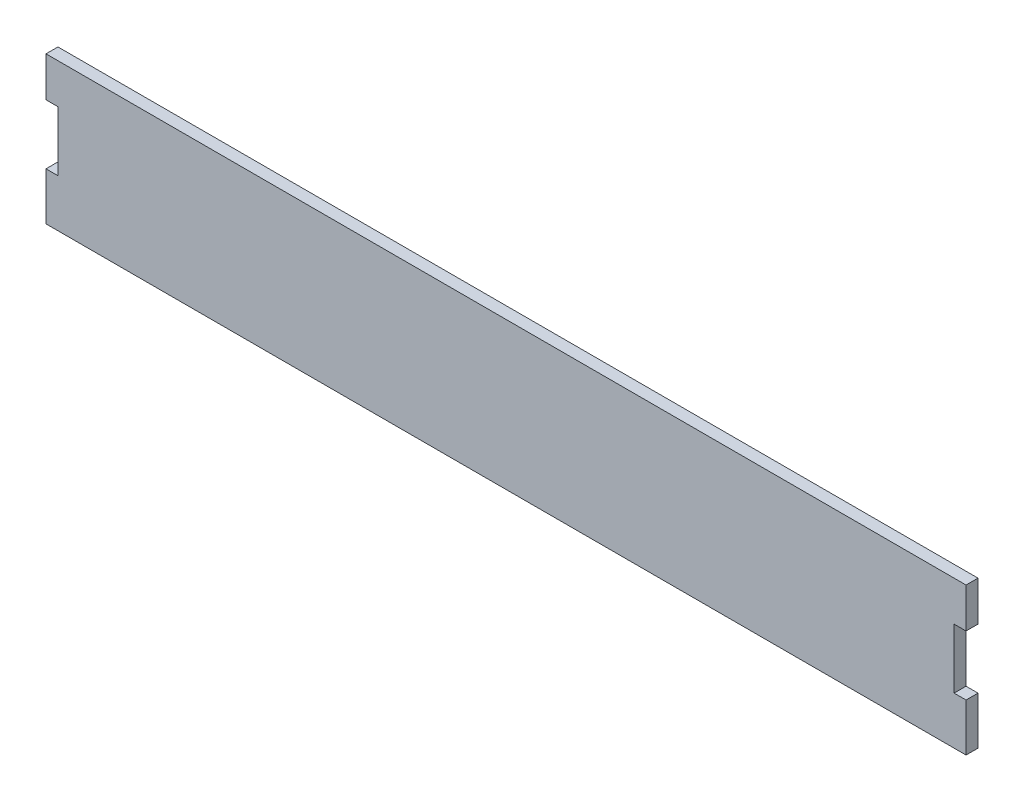
ISO-10303-21;
HEADER;
FILE_DESCRIPTION(('STEP AP214'),'2;1');
FILE_NAME('part.step','',(''),(''),'','','');
FILE_SCHEMA(('AUTOMOTIVE_DESIGN { 1 0 10303 214 1 1 1 1 }'));
ENDSEC;
DATA;
#1=APPLICATION_CONTEXT('core data for automotive mechanical design processes');
#2=APPLICATION_PROTOCOL_DEFINITION('international standard','automotive_design',2000,#1);
#3=PRODUCT_CONTEXT('',#1,'mechanical');
#4=PRODUCT('Part','Part','',(#3));
#5=PRODUCT_RELATED_PRODUCT_CATEGORY('part','',(#4));
#6=PRODUCT_DEFINITION_FORMATION('','',#4);
#7=PRODUCT_DEFINITION_CONTEXT('part definition',#1,'design');
#8=PRODUCT_DEFINITION('design','',#6,#7);
#9=PRODUCT_DEFINITION_SHAPE('','',#8);
#10=(LENGTH_UNIT() NAMED_UNIT(*) SI_UNIT(.MILLI.,.METRE.));
#11=(NAMED_UNIT(*) PLANE_ANGLE_UNIT() SI_UNIT($,.RADIAN.));
#12=(NAMED_UNIT(*) SI_UNIT($,.STERADIAN.) SOLID_ANGLE_UNIT());
#13=UNCERTAINTY_MEASURE_WITH_UNIT(LENGTH_MEASURE(1.E-05),#10,'distance_accuracy_value','');
#14=(GEOMETRIC_REPRESENTATION_CONTEXT(3) GLOBAL_UNCERTAINTY_ASSIGNED_CONTEXT((#13)) GLOBAL_UNIT_ASSIGNED_CONTEXT((#10,
#11,#12)) REPRESENTATION_CONTEXT('',''));
#15=CARTESIAN_POINT('',(0.,0.,0.));
#16=DIRECTION('',(0.,0.,1.));
#17=DIRECTION('',(1.,0.,0.));
#18=AXIS2_PLACEMENT_3D('',#15,#16,#17);
#19=CARTESIAN_POINT('',(114.5,-6.40662954709571,3.));
#20=DIRECTION('',(-1.,0.,0.));
#21=DIRECTION('',(0.,0.,1.));
#22=AXIS2_PLACEMENT_3D('',#19,#20,#21);
#23=PLANE('',#22);
#24=DIRECTION('',(0.,1.,0.));
#25=VECTOR('',#24,1.);
#26=CARTESIAN_POINT('',(114.5,-6.40662954709571,0.));
#27=LINE('',#26,#25);
#28=CARTESIAN_POINT('',(114.5,-18.383137088085,0.));
#29=VERTEX_POINT('',#28);
#30=CARTESIAN_POINT('',(114.5,-6.40662954709571,0.));
#31=VERTEX_POINT('',#30);
#32=EDGE_CURVE('E159',#29,#31,#27,.T.);
#33=ORIENTED_EDGE('',*,*,#32,.T.);
#34=DIRECTION('',(0.,0.,-1.));
#35=VECTOR('',#34,1.);
#36=CARTESIAN_POINT('',(114.5,-6.40662954709571,3.));
#37=LINE('',#36,#35);
#38=CARTESIAN_POINT('',(114.5,-6.40662954709571,3.));
#39=VERTEX_POINT('',#38);
#40=EDGE_CURVE('E42',#39,#31,#37,.T.);
#41=ORIENTED_EDGE('',*,*,#40,.F.);
#42=DIRECTION('',(0.,1.,0.));
#43=VECTOR('',#42,1.);
#44=CARTESIAN_POINT('',(114.5,-6.40662954709571,3.));
#45=LINE('',#44,#43);
#46=CARTESIAN_POINT('',(114.5,-18.383137088085,3.));
#47=VERTEX_POINT('',#46);
#48=EDGE_CURVE('E107',#47,#39,#45,.T.);
#49=ORIENTED_EDGE('',*,*,#48,.F.);
#50=DIRECTION('',(0.,0.,-1.));
#51=VECTOR('',#50,1.);
#52=CARTESIAN_POINT('',(114.5,-18.383137088085,3.));
#53=LINE('',#52,#51);
#54=EDGE_CURVE('E11',#47,#29,#53,.T.);
#55=ORIENTED_EDGE('',*,*,#54,.T.);
#56=EDGE_LOOP('',(#33,#41,#49,#55));
#57=FACE_BOUND('',#56,.T.);
#58=ADVANCED_FACE('F34',(#57),#23,.F.);
#59=CARTESIAN_POINT('',(114.5,-6.40662954709571,3.));
#60=DIRECTION('',(0.,-1.,0.));
#61=DIRECTION('',(1.,0.,0.));
#62=AXIS2_PLACEMENT_3D('',#59,#60,#61);
#63=PLANE('',#62);
#64=DIRECTION('',(-1.,0.,0.));
#65=VECTOR('',#64,1.);
#66=CARTESIAN_POINT('',(114.5,-6.40662954709571,0.));
#67=LINE('',#66,#65);
#68=CARTESIAN_POINT('',(111.5,-6.40662954709572,0.));
#69=VERTEX_POINT('',#68);
#70=EDGE_CURVE('E161',#31,#69,#67,.T.);
#71=ORIENTED_EDGE('',*,*,#70,.T.);
#72=DIRECTION('',(0.,0.,-1.));
#73=VECTOR('',#72,1.);
#74=CARTESIAN_POINT('',(111.5,-6.40662954709572,3.));
#75=LINE('',#74,#73);
#76=CARTESIAN_POINT('',(111.5,-6.40662954709572,3.));
#77=VERTEX_POINT('',#76);
#78=EDGE_CURVE('E199',#77,#69,#75,.T.);
#79=ORIENTED_EDGE('',*,*,#78,.F.);
#80=DIRECTION('',(-1.,0.,0.));
#81=VECTOR('',#80,1.);
#82=CARTESIAN_POINT('',(114.5,-6.40662954709571,3.));
#83=LINE('',#82,#81);
#84=EDGE_CURVE('E207',#39,#77,#83,.T.);
#85=ORIENTED_EDGE('',*,*,#84,.F.);
#86=ORIENTED_EDGE('',*,*,#40,.T.);
#87=EDGE_LOOP('',(#71,#79,#85,#86));
#88=FACE_BOUND('',#87,.T.);
#89=ADVANCED_FACE('F205',(#88),#63,.F.);
#90=CARTESIAN_POINT('',(111.5,8.59337045290429,3.));
#91=DIRECTION('',(-1.,0.,0.));
#92=DIRECTION('',(0.,0.,1.));
#93=AXIS2_PLACEMENT_3D('',#90,#91,#92);
#94=PLANE('',#93);
#95=DIRECTION('',(0.,1.,0.));
#96=VECTOR('',#95,1.);
#97=CARTESIAN_POINT('',(111.5,8.59337045290429,0.));
#98=LINE('',#97,#96);
#99=CARTESIAN_POINT('',(111.5,8.59337045290429,0.));
#100=VERTEX_POINT('',#99);
#101=EDGE_CURVE('E163',#69,#100,#98,.T.);
#102=ORIENTED_EDGE('',*,*,#101,.T.);
#103=DIRECTION('',(0.,0.,-1.));
#104=VECTOR('',#103,1.);
#105=CARTESIAN_POINT('',(111.5,8.59337045290429,3.));
#106=LINE('',#105,#104);
#107=CARTESIAN_POINT('',(111.5,8.59337045290429,3.));
#108=VERTEX_POINT('',#107);
#109=EDGE_CURVE('E196',#108,#100,#106,.T.);
#110=ORIENTED_EDGE('',*,*,#109,.F.);
#111=DIRECTION('',(0.,1.,0.));
#112=VECTOR('',#111,1.);
#113=CARTESIAN_POINT('',(111.5,8.59337045290429,3.));
#114=LINE('',#113,#112);
#115=EDGE_CURVE('E223',#77,#108,#114,.T.);
#116=ORIENTED_EDGE('',*,*,#115,.F.);
#117=ORIENTED_EDGE('',*,*,#78,.T.);
#118=EDGE_LOOP('',(#102,#110,#116,#117));
#119=FACE_BOUND('',#118,.T.);
#120=ADVANCED_FACE('F214',(#119),#94,.F.);
#121=CARTESIAN_POINT('',(111.5,8.59337045290429,3.));
#122=DIRECTION('',(0.,1.,0.));
#123=DIRECTION('',(0.,0.,1.));
#124=AXIS2_PLACEMENT_3D('',#121,#122,#123);
#125=PLANE('',#124);
#126=DIRECTION('',(1.,0.,0.));
#127=VECTOR('',#126,1.);
#128=CARTESIAN_POINT('',(111.5,8.59337045290429,0.));
#129=LINE('',#128,#127);
#130=CARTESIAN_POINT('',(114.5,8.59337045290429,0.));
#131=VERTEX_POINT('',#130);
#132=EDGE_CURVE('E165',#100,#131,#129,.T.);
#133=ORIENTED_EDGE('',*,*,#132,.T.);
#134=DIRECTION('',(0.,0.,-1.));
#135=VECTOR('',#134,1.);
#136=CARTESIAN_POINT('',(114.5,8.59337045290429,3.));
#137=LINE('',#136,#135);
#138=CARTESIAN_POINT('',(114.5,8.59337045290429,3.));
#139=VERTEX_POINT('',#138);
#140=EDGE_CURVE('E193',#139,#131,#137,.T.);
#141=ORIENTED_EDGE('',*,*,#140,.F.);
#142=DIRECTION('',(1.,0.,0.));
#143=VECTOR('',#142,1.);
#144=CARTESIAN_POINT('',(111.5,8.59337045290429,3.));
#145=LINE('',#144,#143);
#146=EDGE_CURVE('E220',#108,#139,#145,.T.);
#147=ORIENTED_EDGE('',*,*,#146,.F.);
#148=ORIENTED_EDGE('',*,*,#109,.T.);
#149=EDGE_LOOP('',(#133,#141,#147,#148));
#150=FACE_BOUND('',#149,.T.);
#151=ADVANCED_FACE('F218',(#150),#125,.F.);
#152=CARTESIAN_POINT('',(114.5,18.5933704529043,3.));
#153=DIRECTION('',(-1.,0.,0.));
#154=DIRECTION('',(0.,-1.,0.));
#155=AXIS2_PLACEMENT_3D('',#152,#153,#154);
#156=PLANE('',#155);
#157=DIRECTION('',(0.,1.,0.));
#158=VECTOR('',#157,1.);
#159=CARTESIAN_POINT('',(114.5,18.5933704529043,0.));
#160=LINE('',#159,#158);
#161=CARTESIAN_POINT('',(114.5,18.5933704529043,0.));
#162=VERTEX_POINT('',#161);
#163=EDGE_CURVE('E167',#131,#162,#160,.T.);
#164=ORIENTED_EDGE('',*,*,#163,.T.);
#165=DIRECTION('',(0.,0.,-1.));
#166=VECTOR('',#165,1.);
#167=CARTESIAN_POINT('',(114.5,18.5933704529043,3.));
#168=LINE('',#167,#166);
#169=CARTESIAN_POINT('',(114.5,18.5933704529043,3.));
#170=VERTEX_POINT('',#169);
#171=EDGE_CURVE('E190',#170,#162,#168,.T.);
#172=ORIENTED_EDGE('',*,*,#171,.F.);
#173=DIRECTION('',(0.,1.,0.));
#174=VECTOR('',#173,1.);
#175=CARTESIAN_POINT('',(114.5,18.5933704529043,3.));
#176=LINE('',#175,#174);
#177=EDGE_CURVE('E222',#139,#170,#176,.T.);
#178=ORIENTED_EDGE('',*,*,#177,.F.);
#179=ORIENTED_EDGE('',*,*,#140,.T.);
#180=EDGE_LOOP('',(#164,#172,#178,#179));
#181=FACE_BOUND('',#180,.T.);
#182=ADVANCED_FACE('F257',(#181),#156,.F.);
#183=CARTESIAN_POINT('',(-113.5,18.5933704529043,3.));
#184=DIRECTION('',(0.,-1.,0.));
#185=DIRECTION('',(1.,0.,0.));
#186=AXIS2_PLACEMENT_3D('',#183,#184,#185);
#187=PLANE('',#186);
#188=DIRECTION('',(-1.,0.,0.));
#189=VECTOR('',#188,1.);
#190=CARTESIAN_POINT('',(-113.5,18.5933704529043,0.));
#191=LINE('',#190,#189);
#192=CARTESIAN_POINT('',(-116.5,18.5933704529042,0.));
#193=VERTEX_POINT('',#192);
#194=EDGE_CURVE('E170',#162,#193,#191,.T.);
#195=ORIENTED_EDGE('',*,*,#194,.T.);
#196=DIRECTION('',(0.,0.,-1.));
#197=VECTOR('',#196,1.);
#198=CARTESIAN_POINT('',(-116.5,18.5933704529042,3.));
#199=LINE('',#198,#197);
#200=CARTESIAN_POINT('',(-116.5,18.5933704529042,3.));
#201=VERTEX_POINT('',#200);
#202=EDGE_CURVE('E187',#201,#193,#199,.T.);
#203=ORIENTED_EDGE('',*,*,#202,.F.);
#204=DIRECTION('',(-1.,0.,0.));
#205=VECTOR('',#204,1.);
#206=CARTESIAN_POINT('',(111.5,18.5933704529043,3.));
#207=LINE('',#206,#205);
#208=EDGE_CURVE('E225',#170,#201,#207,.T.);
#209=ORIENTED_EDGE('',*,*,#208,.F.);
#210=ORIENTED_EDGE('',*,*,#171,.T.);
#211=EDGE_LOOP('',(#195,#203,#209,#210));
#212=FACE_BOUND('',#211,.T.);
#213=ADVANCED_FACE('F260',(#212),#187,.F.);
#214=CARTESIAN_POINT('',(-116.5,18.5933704529042,3.));
#215=DIRECTION('',(1.,0.,0.));
#216=DIRECTION('',(0.,0.,-1.));
#217=AXIS2_PLACEMENT_3D('',#214,#215,#216);
#218=PLANE('',#217);
#219=DIRECTION('',(0.,-1.,0.));
#220=VECTOR('',#219,1.);
#221=CARTESIAN_POINT('',(-116.5,18.5933704529042,0.));
#222=LINE('',#221,#220);
#223=CARTESIAN_POINT('',(-116.5,8.59337045290423,0.));
#224=VERTEX_POINT('',#223);
#225=EDGE_CURVE('E172',#193,#224,#222,.T.);
#226=ORIENTED_EDGE('',*,*,#225,.T.);
#227=DIRECTION('',(0.,0.,-1.));
#228=VECTOR('',#227,1.);
#229=CARTESIAN_POINT('',(-116.5,8.59337045290423,3.));
#230=LINE('',#229,#228);
#231=CARTESIAN_POINT('',(-116.5,8.59337045290423,3.));
#232=VERTEX_POINT('',#231);
#233=EDGE_CURVE('E184',#232,#224,#230,.T.);
#234=ORIENTED_EDGE('',*,*,#233,.F.);
#235=DIRECTION('',(0.,-1.,0.));
#236=VECTOR('',#235,1.);
#237=CARTESIAN_POINT('',(-116.5,18.5933704529042,3.));
#238=LINE('',#237,#236);
#239=EDGE_CURVE('E231',#201,#232,#238,.T.);
#240=ORIENTED_EDGE('',*,*,#239,.F.);
#241=ORIENTED_EDGE('',*,*,#202,.T.);
#242=EDGE_LOOP('',(#226,#234,#240,#241));
#243=FACE_BOUND('',#242,.T.);
#244=ADVANCED_FACE('F237',(#243),#218,.F.);
#245=CARTESIAN_POINT('',(-113.5,8.59337045290429,3.));
#246=DIRECTION('',(0.,1.,0.));
#247=DIRECTION('',(-1.,0.,0.));
#248=AXIS2_PLACEMENT_3D('',#245,#246,#247);
#249=PLANE('',#248);
#250=DIRECTION('',(1.,0.,0.));
#251=VECTOR('',#250,1.);
#252=CARTESIAN_POINT('',(-113.5,8.59337045290429,0.));
#253=LINE('',#252,#251);
#254=CARTESIAN_POINT('',(-113.5,8.59337045290429,0.));
#255=VERTEX_POINT('',#254);
#256=EDGE_CURVE('E174',#224,#255,#253,.T.);
#257=ORIENTED_EDGE('',*,*,#256,.T.);
#258=DIRECTION('',(0.,0.,-1.));
#259=VECTOR('',#258,1.);
#260=CARTESIAN_POINT('',(-113.5,8.59337045290429,3.));
#261=LINE('',#260,#259);
#262=CARTESIAN_POINT('',(-113.5,8.59337045290429,3.));
#263=VERTEX_POINT('',#262);
#264=EDGE_CURVE('E148',#263,#255,#261,.T.);
#265=ORIENTED_EDGE('',*,*,#264,.F.);
#266=DIRECTION('',(1.,0.,0.));
#267=VECTOR('',#266,1.);
#268=CARTESIAN_POINT('',(-113.5,8.59337045290429,3.));
#269=LINE('',#268,#267);
#270=EDGE_CURVE('E139',#232,#263,#269,.T.);
#271=ORIENTED_EDGE('',*,*,#270,.F.);
#272=ORIENTED_EDGE('',*,*,#233,.T.);
#273=EDGE_LOOP('',(#257,#265,#271,#272));
#274=FACE_BOUND('',#273,.T.);
#275=ADVANCED_FACE('F241',(#274),#249,.F.);
#276=CARTESIAN_POINT('',(-113.5,8.59337045290429,3.));
#277=DIRECTION('',(1.,0.,0.));
#278=DIRECTION('',(0.,0.,-1.));
#279=AXIS2_PLACEMENT_3D('',#276,#277,#278);
#280=PLANE('',#279);
#281=DIRECTION('',(0.,-1.,0.));
#282=VECTOR('',#281,1.);
#283=CARTESIAN_POINT('',(-113.5,8.59337045290429,0.));
#284=LINE('',#283,#282);
#285=CARTESIAN_POINT('',(-113.5,-6.40662954709574,0.));
#286=VERTEX_POINT('',#285);
#287=EDGE_CURVE('E147',#255,#286,#284,.T.);
#288=ORIENTED_EDGE('',*,*,#287,.T.);
#289=DIRECTION('',(0.,0.,-1.));
#290=VECTOR('',#289,1.);
#291=CARTESIAN_POINT('',(-113.5,-6.40662954709574,3.));
#292=LINE('',#291,#290);
#293=CARTESIAN_POINT('',(-113.5,-6.40662954709574,3.));
#294=VERTEX_POINT('',#293);
#295=EDGE_CURVE('E144',#294,#286,#292,.T.);
#296=ORIENTED_EDGE('',*,*,#295,.F.);
#297=DIRECTION('',(0.,-1.,0.));
#298=VECTOR('',#297,1.);
#299=CARTESIAN_POINT('',(-113.5,8.59337045290429,3.));
#300=LINE('',#299,#298);
#301=EDGE_CURVE('E133',#263,#294,#300,.T.);
#302=ORIENTED_EDGE('',*,*,#301,.F.);
#303=ORIENTED_EDGE('',*,*,#264,.T.);
#304=EDGE_LOOP('',(#288,#296,#302,#303));
#305=FACE_BOUND('',#304,.T.);
#306=ADVANCED_FACE('F145',(#305),#280,.F.);
#307=CARTESIAN_POINT('',(-116.5,-6.40662954709574,3.));
#308=DIRECTION('',(0.,-1.,0.));
#309=DIRECTION('',(1.,0.,0.));
#310=AXIS2_PLACEMENT_3D('',#307,#308,#309);
#311=PLANE('',#310);
#312=DIRECTION('',(-1.,0.,0.));
#313=VECTOR('',#312,1.);
#314=CARTESIAN_POINT('',(-116.5,-6.40662954709574,0.));
#315=LINE('',#314,#313);
#316=CARTESIAN_POINT('',(-116.5,-6.40662954709574,0.));
#317=VERTEX_POINT('',#316);
#318=EDGE_CURVE('E92',#286,#317,#315,.T.);
#319=ORIENTED_EDGE('',*,*,#318,.T.);
#320=DIRECTION('',(0.,0.,-1.));
#321=VECTOR('',#320,1.);
#322=CARTESIAN_POINT('',(-116.5,-6.40662954709574,3.));
#323=LINE('',#322,#321);
#324=CARTESIAN_POINT('',(-116.5,-6.40662954709574,3.));
#325=VERTEX_POINT('',#324);
#326=EDGE_CURVE('E149',#325,#317,#323,.T.);
#327=ORIENTED_EDGE('',*,*,#326,.F.);
#328=DIRECTION('',(-1.,0.,0.));
#329=VECTOR('',#328,1.);
#330=CARTESIAN_POINT('',(-116.5,-6.40662954709574,3.));
#331=LINE('',#330,#329);
#332=EDGE_CURVE('E137',#294,#325,#331,.T.);
#333=ORIENTED_EDGE('',*,*,#332,.F.);
#334=ORIENTED_EDGE('',*,*,#295,.T.);
#335=EDGE_LOOP('',(#319,#327,#333,#334));
#336=FACE_BOUND('',#335,.T.);
#337=ADVANCED_FACE('F151',(#336),#311,.F.);
#338=CARTESIAN_POINT('',(-116.5,-6.40662954709574,3.));
#339=DIRECTION('',(1.,0.,0.));
#340=DIRECTION('',(0.,0.,-1.));
#341=AXIS2_PLACEMENT_3D('',#338,#339,#340);
#342=PLANE('',#341);
#343=DIRECTION('',(0.,-1.,0.));
#344=VECTOR('',#343,1.);
#345=CARTESIAN_POINT('',(-116.5,-6.40662954709574,0.));
#346=LINE('',#345,#344);
#347=CARTESIAN_POINT('',(-116.5,-18.3831370880851,0.));
#348=VERTEX_POINT('',#347);
#349=EDGE_CURVE('E178',#317,#348,#346,.T.);
#350=ORIENTED_EDGE('',*,*,#349,.T.);
#351=DIRECTION('',(0.,0.,-1.));
#352=VECTOR('',#351,1.);
#353=CARTESIAN_POINT('',(-116.5,-18.3831370880851,3.));
#354=LINE('',#353,#352);
#355=CARTESIAN_POINT('',(-116.5,-18.3831370880851,3.));
#356=VERTEX_POINT('',#355);
#357=EDGE_CURVE('E155',#356,#348,#354,.T.);
#358=ORIENTED_EDGE('',*,*,#357,.F.);
#359=DIRECTION('',(0.,-1.,0.));
#360=VECTOR('',#359,1.);
#361=CARTESIAN_POINT('',(-116.5,-6.40662954709574,3.));
#362=LINE('',#361,#360);
#363=EDGE_CURVE('E153',#325,#356,#362,.T.);
#364=ORIENTED_EDGE('',*,*,#363,.F.);
#365=ORIENTED_EDGE('',*,*,#326,.T.);
#366=EDGE_LOOP('',(#350,#358,#364,#365));
#367=FACE_BOUND('',#366,.T.);
#368=ADVANCED_FACE('F244',(#367),#342,.F.);
#369=CARTESIAN_POINT('',(-110.239280743278,-18.3831370880851,3.));
#370=DIRECTION('',(0.,1.,0.));
#371=DIRECTION('',(-1.,0.,0.));
#372=AXIS2_PLACEMENT_3D('',#369,#370,#371);
#373=PLANE('',#372);
#374=DIRECTION('',(1.,0.,0.));
#375=VECTOR('',#374,1.);
#376=CARTESIAN_POINT('',(-110.239280743278,-18.3831370880851,0.));
#377=LINE('',#376,#375);
#378=EDGE_CURVE('E99',#348,#29,#377,.T.);
#379=ORIENTED_EDGE('',*,*,#378,.T.);
#380=ORIENTED_EDGE('',*,*,#54,.F.);
#381=DIRECTION('',(1.,0.,0.));
#382=VECTOR('',#381,1.);
#383=CARTESIAN_POINT('',(114.5,-18.383137088085,3.));
#384=LINE('',#383,#382);
#385=EDGE_CURVE('E50',#356,#47,#384,.T.);
#386=ORIENTED_EDGE('',*,*,#385,.F.);
#387=ORIENTED_EDGE('',*,*,#357,.T.);
#388=EDGE_LOOP('',(#379,#380,#386,#387));
#389=FACE_BOUND('',#388,.T.);
#390=ADVANCED_FACE('F245',(#389),#373,.F.);
#391=CARTESIAN_POINT('',(0.,0.,3.));
#392=DIRECTION('',(0.,0.,1.));
#393=DIRECTION('',(1.,0.,0.));
#394=AXIS2_PLACEMENT_3D('',#391,#392,#393);
#395=PLANE('',#394);
#396=ORIENTED_EDGE('',*,*,#385,.T.);
#397=ORIENTED_EDGE('',*,*,#48,.T.);
#398=ORIENTED_EDGE('',*,*,#84,.T.);
#399=ORIENTED_EDGE('',*,*,#115,.T.);
#400=ORIENTED_EDGE('',*,*,#146,.T.);
#401=ORIENTED_EDGE('',*,*,#177,.T.);
#402=ORIENTED_EDGE('',*,*,#208,.T.);
#403=ORIENTED_EDGE('',*,*,#239,.T.);
#404=ORIENTED_EDGE('',*,*,#270,.T.);
#405=ORIENTED_EDGE('',*,*,#301,.T.);
#406=ORIENTED_EDGE('',*,*,#332,.T.);
#407=ORIENTED_EDGE('',*,*,#363,.T.);
#408=EDGE_LOOP('',(#396,#397,#398,#399,#400,#401,#402,#403,#404,#405,#406,#407));
#409=FACE_BOUND('',#408,.T.);
#410=ADVANCED_FACE('F135',(#409),#395,.T.);
#411=CARTESIAN_POINT('',(0.,0.,0.));
#412=DIRECTION('',(0.,0.,1.));
#413=DIRECTION('',(1.,0.,0.));
#414=AXIS2_PLACEMENT_3D('',#411,#412,#413);
#415=PLANE('',#414);
#416=ORIENTED_EDGE('',*,*,#32,.F.);
#417=ORIENTED_EDGE('',*,*,#378,.F.);
#418=ORIENTED_EDGE('',*,*,#349,.F.);
#419=ORIENTED_EDGE('',*,*,#318,.F.);
#420=ORIENTED_EDGE('',*,*,#287,.F.);
#421=ORIENTED_EDGE('',*,*,#256,.F.);
#422=ORIENTED_EDGE('',*,*,#225,.F.);
#423=ORIENTED_EDGE('',*,*,#194,.F.);
#424=ORIENTED_EDGE('',*,*,#163,.F.);
#425=ORIENTED_EDGE('',*,*,#132,.F.);
#426=ORIENTED_EDGE('',*,*,#101,.F.);
#427=ORIENTED_EDGE('',*,*,#70,.F.);
#428=EDGE_LOOP('',(#416,#417,#418,#419,#420,#421,#422,#423,#424,#425,#426,#427));
#429=FACE_BOUND('',#428,.T.);
#430=ADVANCED_FACE('F209',(#429),#415,.F.);
#431=CLOSED_SHELL('',(#58,#89,#120,#151,#182,#213,#244,#275,#306,#337,#368,#390,#410,#430));
#432=MANIFOLD_SOLID_BREP('B2',#431);
#433=ADVANCED_BREP_SHAPE_REPRESENTATION('',(#18,#432),#14);
#434=SHAPE_DEFINITION_REPRESENTATION(#9,#433);
ENDSEC;
END-ISO-10303-21;
